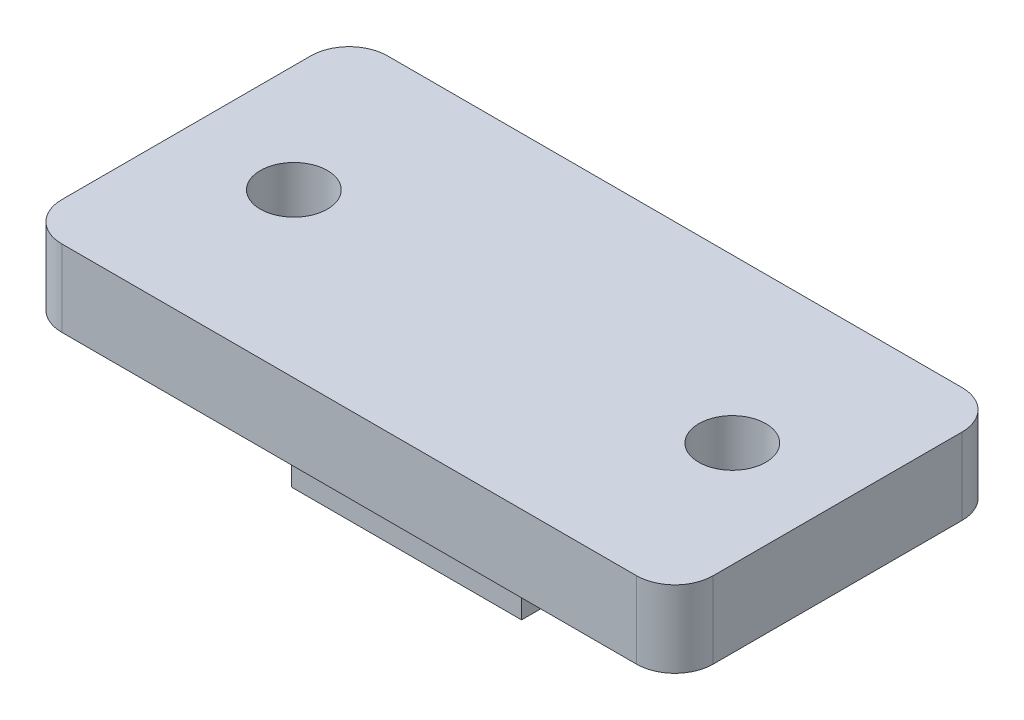
ISO-10303-21;
HEADER;
FILE_DESCRIPTION(('STEP AP214'),'2;1');
FILE_NAME('part.step','',(''),(''),'','','');
FILE_SCHEMA(('AUTOMOTIVE_DESIGN { 1 0 10303 214 1 1 1 1 }'));
ENDSEC;
DATA;
#1=APPLICATION_CONTEXT('core data for automotive mechanical design processes');
#2=APPLICATION_PROTOCOL_DEFINITION('international standard','automotive_design',2000,#1);
#3=PRODUCT_CONTEXT('',#1,'mechanical');
#4=PRODUCT('Part','Part','',(#3));
#5=PRODUCT_RELATED_PRODUCT_CATEGORY('part','',(#4));
#6=PRODUCT_DEFINITION_FORMATION('','',#4);
#7=PRODUCT_DEFINITION_CONTEXT('part definition',#1,'design');
#8=PRODUCT_DEFINITION('design','',#6,#7);
#9=PRODUCT_DEFINITION_SHAPE('','',#8);
#10=(LENGTH_UNIT() NAMED_UNIT(*) SI_UNIT(.MILLI.,.METRE.));
#11=(NAMED_UNIT(*) PLANE_ANGLE_UNIT() SI_UNIT($,.RADIAN.));
#12=(NAMED_UNIT(*) SI_UNIT($,.STERADIAN.) SOLID_ANGLE_UNIT());
#13=UNCERTAINTY_MEASURE_WITH_UNIT(LENGTH_MEASURE(1.E-05),#10,'distance_accuracy_value','');
#14=(GEOMETRIC_REPRESENTATION_CONTEXT(3) GLOBAL_UNCERTAINTY_ASSIGNED_CONTEXT((#13)) GLOBAL_UNIT_ASSIGNED_CONTEXT((#10,
#11,#12)) REPRESENTATION_CONTEXT('',''));
#15=CARTESIAN_POINT('',(0.,0.,0.));
#16=DIRECTION('',(0.,0.,1.));
#17=DIRECTION('',(1.,0.,0.));
#18=AXIS2_PLACEMENT_3D('',#15,#16,#17);
#19=CARTESIAN_POINT('',(0.,4.,0.));
#20=DIRECTION('',(1.,0.,0.));
#21=DIRECTION('',(0.,0.,-1.));
#22=AXIS2_PLACEMENT_3D('',#19,#20,#21);
#23=PLANE('',#22);
#24=DIRECTION('',(0.,0.,1.));
#25=VECTOR('',#24,1.);
#26=CARTESIAN_POINT('',(0.,0.,0.));
#27=LINE('',#26,#25);
#28=CARTESIAN_POINT('',(0.,0.,0.));
#29=VERTEX_POINT('',#28);
#30=CARTESIAN_POINT('',(0.,0.,11.));
#31=VERTEX_POINT('',#30);
#32=EDGE_CURVE('E153',#29,#31,#27,.T.);
#33=ORIENTED_EDGE('',*,*,#32,.T.);
#34=DIRECTION('',(0.,-1.,0.));
#35=VECTOR('',#34,1.);
#36=CARTESIAN_POINT('',(0.,4.,11.));
#37=LINE('',#36,#35);
#38=CARTESIAN_POINT('',(0.,4.,11.));
#39=VERTEX_POINT('',#38);
#40=EDGE_CURVE('E130',#39,#31,#37,.T.);
#41=ORIENTED_EDGE('',*,*,#40,.F.);
#42=DIRECTION('',(0.,0.,1.));
#43=VECTOR('',#42,1.);
#44=CARTESIAN_POINT('',(0.,4.,0.));
#45=LINE('',#44,#43);
#46=CARTESIAN_POINT('',(0.,4.,0.));
#47=VERTEX_POINT('',#46);
#48=EDGE_CURVE('E124',#47,#39,#45,.T.);
#49=ORIENTED_EDGE('',*,*,#48,.F.);
#50=DIRECTION('',(0.,-1.,0.));
#51=VECTOR('',#50,1.);
#52=CARTESIAN_POINT('',(0.,4.,0.));
#53=LINE('',#52,#51);
#54=EDGE_CURVE('E127',#47,#29,#53,.T.);
#55=ORIENTED_EDGE('',*,*,#54,.T.);
#56=EDGE_LOOP('',(#33,#41,#49,#55));
#57=FACE_BOUND('',#56,.T.);
#58=ADVANCED_FACE('F33',(#57),#23,.F.);
#59=CARTESIAN_POINT('',(0.,4.,11.));
#60=DIRECTION('',(0.,0.,-1.));
#61=DIRECTION('',(-1.,0.,0.));
#62=AXIS2_PLACEMENT_3D('',#59,#60,#61);
#63=PLANE('',#62);
#64=DIRECTION('',(1.,0.,0.));
#65=VECTOR('',#64,1.);
#66=CARTESIAN_POINT('',(0.,0.,11.));
#67=LINE('',#66,#65);
#68=CARTESIAN_POINT('',(12.,0.,11.));
#69=VERTEX_POINT('',#68);
#70=EDGE_CURVE('E155',#31,#69,#67,.T.);
#71=ORIENTED_EDGE('',*,*,#70,.T.);
#72=DIRECTION('',(0.,-1.,0.));
#73=VECTOR('',#72,1.);
#74=CARTESIAN_POINT('',(12.,4.,11.));
#75=LINE('',#74,#73);
#76=CARTESIAN_POINT('',(12.,4.,11.));
#77=VERTEX_POINT('',#76);
#78=EDGE_CURVE('E162',#77,#69,#75,.T.);
#79=ORIENTED_EDGE('',*,*,#78,.F.);
#80=DIRECTION('',(1.,0.,0.));
#81=VECTOR('',#80,1.);
#82=CARTESIAN_POINT('',(0.,4.,11.));
#83=LINE('',#82,#81);
#84=EDGE_CURVE('E134',#39,#77,#83,.T.);
#85=ORIENTED_EDGE('',*,*,#84,.F.);
#86=ORIENTED_EDGE('',*,*,#40,.T.);
#87=EDGE_LOOP('',(#71,#79,#85,#86));
#88=FACE_BOUND('',#87,.T.);
#89=ADVANCED_FACE('F225',(#88),#63,.F.);
#90=CARTESIAN_POINT('',(12.,4.,0.));
#91=DIRECTION('',(-1.,0.,0.));
#92=DIRECTION('',(0.,0.,1.));
#93=AXIS2_PLACEMENT_3D('',#90,#91,#92);
#94=PLANE('',#93);
#95=DIRECTION('',(0.,0.,-1.));
#96=VECTOR('',#95,1.);
#97=CARTESIAN_POINT('',(12.,0.,0.));
#98=LINE('',#97,#96);
#99=CARTESIAN_POINT('',(12.,0.,0.));
#100=VERTEX_POINT('',#99);
#101=EDGE_CURVE('E158',#69,#100,#98,.T.);
#102=ORIENTED_EDGE('',*,*,#101,.T.);
#103=DIRECTION('',(0.,-1.,0.));
#104=VECTOR('',#103,1.);
#105=CARTESIAN_POINT('',(12.,4.,0.));
#106=LINE('',#105,#104);
#107=CARTESIAN_POINT('',(12.,4.,0.));
#108=VERTEX_POINT('',#107);
#109=EDGE_CURVE('E144',#108,#100,#106,.T.);
#110=ORIENTED_EDGE('',*,*,#109,.F.);
#111=DIRECTION('',(0.,0.,-1.));
#112=VECTOR('',#111,1.);
#113=CARTESIAN_POINT('',(12.,4.,0.));
#114=LINE('',#113,#112);
#115=EDGE_CURVE('E148',#77,#108,#114,.T.);
#116=ORIENTED_EDGE('',*,*,#115,.F.);
#117=ORIENTED_EDGE('',*,*,#78,.T.);
#118=EDGE_LOOP('',(#102,#110,#116,#117));
#119=FACE_BOUND('',#118,.T.);
#120=ADVANCED_FACE('F228',(#119),#94,.F.);
#121=CARTESIAN_POINT('',(0.,4.,0.));
#122=DIRECTION('',(0.,0.,1.));
#123=DIRECTION('',(1.,0.,0.));
#124=AXIS2_PLACEMENT_3D('',#121,#122,#123);
#125=PLANE('',#124);
#126=DIRECTION('',(-1.,0.,0.));
#127=VECTOR('',#126,1.);
#128=CARTESIAN_POINT('',(0.,0.,0.));
#129=LINE('',#128,#127);
#130=EDGE_CURVE('E135',#100,#29,#129,.T.);
#131=ORIENTED_EDGE('',*,*,#130,.T.);
#132=ORIENTED_EDGE('',*,*,#54,.F.);
#133=DIRECTION('',(-1.,0.,0.));
#134=VECTOR('',#133,1.);
#135=CARTESIAN_POINT('',(0.,4.,0.));
#136=LINE('',#135,#134);
#137=EDGE_CURVE('E141',#108,#47,#136,.T.);
#138=ORIENTED_EDGE('',*,*,#137,.F.);
#139=ORIENTED_EDGE('',*,*,#109,.T.);
#140=EDGE_LOOP('',(#131,#132,#138,#139));
#141=FACE_BOUND('',#140,.T.);
#142=ADVANCED_FACE('F139',(#141),#125,.F.);
#143=CARTESIAN_POINT('',(0.,0.,0.));
#144=DIRECTION('',(0.,1.,0.));
#145=DIRECTION('',(0.,0.,1.));
#146=AXIS2_PLACEMENT_3D('',#143,#144,#145);
#147=PLANE('',#146);
#148=ORIENTED_EDGE('',*,*,#32,.F.);
#149=ORIENTED_EDGE('',*,*,#130,.F.);
#150=ORIENTED_EDGE('',*,*,#101,.F.);
#151=ORIENTED_EDGE('',*,*,#70,.F.);
#152=EDGE_LOOP('',(#148,#149,#150,#151));
#153=FACE_BOUND('',#152,.T.);
#154=ADVANCED_FACE('F230',(#153),#147,.F.);
#155=CARTESIAN_POINT('',(0.,4.,0.));
#156=DIRECTION('',(0.,1.,0.));
#157=DIRECTION('',(0.,0.,1.));
#158=AXIS2_PLACEMENT_3D('',#155,#156,#157);
#159=PLANE('',#158);
#160=CARTESIAN_POINT('',(-5.38539953723421,4.,5.5));
#161=DIRECTION('',(0.,-1.,0.));
#162=DIRECTION('',(0.,0.,-1.));
#163=AXIS2_PLACEMENT_3D('',#160,#161,#162);
#164=CIRCLE('',#163,1.75);
#165=CARTESIAN_POINT('',(-5.38539953723421,4.,3.75));
#166=VERTEX_POINT('',#165);
#167=EDGE_CURVE('E216',#166,#166,#164,.T.);
#168=ORIENTED_EDGE('',*,*,#167,.F.);
#169=EDGE_LOOP('',(#168));
#170=FACE_BOUND('',#169,.T.);
#171=CARTESIAN_POINT('',(17.5,4.,5.5));
#172=DIRECTION('',(0.,-1.,0.));
#173=DIRECTION('',(0.,0.,-1.));
#174=AXIS2_PLACEMENT_3D('',#171,#172,#173);
#175=CIRCLE('',#174,1.75);
#176=CARTESIAN_POINT('',(17.5,4.,3.75));
#177=VERTEX_POINT('',#176);
#178=EDGE_CURVE('E280',#177,#177,#175,.T.);
#179=ORIENTED_EDGE('',*,*,#178,.F.);
#180=EDGE_LOOP('',(#179));
#181=FACE_BOUND('',#180,.T.);
#182=DIRECTION('',(1.,0.,0.));
#183=VECTOR('',#182,1.);
#184=CARTESIAN_POINT('',(-11.,4.,14.));
#185=LINE('',#184,#183);
#186=CARTESIAN_POINT('',(-9.,4.,14.));
#187=VERTEX_POINT('',#186);
#188=CARTESIAN_POINT('',(21.,4.,14.));
#189=VERTEX_POINT('',#188);
#190=EDGE_CURVE('E223',#187,#189,#185,.T.);
#191=ORIENTED_EDGE('',*,*,#190,.F.);
#192=CARTESIAN_POINT('',(-9.,4.,12.));
#193=DIRECTION('',(0.,1.,0.));
#194=DIRECTION('',(0.,0.,1.));
#195=AXIS2_PLACEMENT_3D('',#192,#193,#194);
#196=CIRCLE('',#195,2.);
#197=CARTESIAN_POINT('',(-11.,4.,12.));
#198=VERTEX_POINT('',#197);
#199=EDGE_CURVE('E177',#187,#198,#196,.F.);
#200=ORIENTED_EDGE('',*,*,#199,.T.);
#201=DIRECTION('',(0.,0.,1.));
#202=VECTOR('',#201,1.);
#203=CARTESIAN_POINT('',(-11.,4.,-3.));
#204=LINE('',#203,#202);
#205=CARTESIAN_POINT('',(-11.,4.,-1.));
#206=VERTEX_POINT('',#205);
#207=EDGE_CURVE('E213',#206,#198,#204,.T.);
#208=ORIENTED_EDGE('',*,*,#207,.F.);
#209=CARTESIAN_POINT('',(-9.,4.,-1.));
#210=DIRECTION('',(0.,1.,0.));
#211=DIRECTION('',(0.,0.,1.));
#212=AXIS2_PLACEMENT_3D('',#209,#210,#211);
#213=CIRCLE('',#212,2.);
#214=CARTESIAN_POINT('',(-9.,4.,-3.));
#215=VERTEX_POINT('',#214);
#216=EDGE_CURVE('E175',#206,#215,#213,.F.);
#217=ORIENTED_EDGE('',*,*,#216,.T.);
#218=DIRECTION('',(-1.,0.,0.));
#219=VECTOR('',#218,1.);
#220=CARTESIAN_POINT('',(-11.,4.,-3.));
#221=LINE('',#220,#219);
#222=CARTESIAN_POINT('',(21.,4.,-3.));
#223=VERTEX_POINT('',#222);
#224=EDGE_CURVE('E210',#223,#215,#221,.T.);
#225=ORIENTED_EDGE('',*,*,#224,.F.);
#226=CARTESIAN_POINT('',(21.,4.,-1.));
#227=DIRECTION('',(0.,1.,0.));
#228=DIRECTION('',(0.,0.,1.));
#229=AXIS2_PLACEMENT_3D('',#226,#227,#228);
#230=CIRCLE('',#229,2.);
#231=CARTESIAN_POINT('',(23.,4.,-1.));
#232=VERTEX_POINT('',#231);
#233=EDGE_CURVE('E173',#223,#232,#230,.F.);
#234=ORIENTED_EDGE('',*,*,#233,.T.);
#235=DIRECTION('',(0.,0.,-1.));
#236=VECTOR('',#235,1.);
#237=CARTESIAN_POINT('',(23.,4.,-3.));
#238=LINE('',#237,#236);
#239=CARTESIAN_POINT('',(23.,4.,12.));
#240=VERTEX_POINT('',#239);
#241=EDGE_CURVE('E201',#240,#232,#238,.T.);
#242=ORIENTED_EDGE('',*,*,#241,.F.);
#243=CARTESIAN_POINT('',(21.,4.,12.));
#244=DIRECTION('',(0.,1.,0.));
#245=DIRECTION('',(0.,0.,1.));
#246=AXIS2_PLACEMENT_3D('',#243,#244,#245);
#247=CIRCLE('',#246,2.);
#248=EDGE_CURVE('E171',#240,#189,#247,.F.);
#249=ORIENTED_EDGE('',*,*,#248,.T.);
#250=EDGE_LOOP('',(#191,#200,#208,#217,#225,#234,#242,#249));
#251=FACE_BOUND('',#250,.T.);
#252=ORIENTED_EDGE('',*,*,#137,.T.);
#253=ORIENTED_EDGE('',*,*,#48,.T.);
#254=ORIENTED_EDGE('',*,*,#84,.T.);
#255=ORIENTED_EDGE('',*,*,#115,.T.);
#256=EDGE_LOOP('',(#252,#253,#254,#255));
#257=FACE_BOUND('',#256,.T.);
#258=ADVANCED_FACE('F146',(#170,#181,#251,#257),#159,.F.);
#259=CARTESIAN_POINT('',(23.,8.,-3.));
#260=DIRECTION('',(-1.,0.,0.));
#261=DIRECTION('',(0.,0.,1.));
#262=AXIS2_PLACEMENT_3D('',#259,#260,#261);
#263=PLANE('',#262);
#264=ORIENTED_EDGE('',*,*,#241,.T.);
#265=DIRECTION('',(0.,-1.,0.));
#266=VECTOR('',#265,1.);
#267=CARTESIAN_POINT('',(23.,8.,-1.));
#268=LINE('',#267,#266);
#269=CARTESIAN_POINT('',(23.,8.,-1.));
#270=VERTEX_POINT('',#269);
#271=EDGE_CURVE('E11',#232,#270,#268,.F.);
#272=ORIENTED_EDGE('',*,*,#271,.T.);
#273=DIRECTION('',(0.,0.,-1.));
#274=VECTOR('',#273,1.);
#275=CARTESIAN_POINT('',(23.,8.,-3.));
#276=LINE('',#275,#274);
#277=CARTESIAN_POINT('',(23.,8.,12.));
#278=VERTEX_POINT('',#277);
#279=EDGE_CURVE('E203',#278,#270,#276,.T.);
#280=ORIENTED_EDGE('',*,*,#279,.F.);
#281=DIRECTION('',(0.,-1.,0.));
#282=VECTOR('',#281,1.);
#283=CARTESIAN_POINT('',(23.,8.,12.));
#284=LINE('',#283,#282);
#285=EDGE_CURVE('E41',#278,#240,#284,.T.);
#286=ORIENTED_EDGE('',*,*,#285,.T.);
#287=EDGE_LOOP('',(#264,#272,#280,#286));
#288=FACE_BOUND('',#287,.T.);
#289=ADVANCED_FACE('F200',(#288),#263,.F.);
#290=CARTESIAN_POINT('',(-11.,8.,-3.));
#291=DIRECTION('',(0.,0.,1.));
#292=DIRECTION('',(1.,0.,0.));
#293=AXIS2_PLACEMENT_3D('',#290,#291,#292);
#294=PLANE('',#293);
#295=ORIENTED_EDGE('',*,*,#224,.T.);
#296=DIRECTION('',(0.,-1.,0.));
#297=VECTOR('',#296,1.);
#298=CARTESIAN_POINT('',(-9.,8.,-3.));
#299=LINE('',#298,#297);
#300=CARTESIAN_POINT('',(-9.,8.,-3.));
#301=VERTEX_POINT('',#300);
#302=EDGE_CURVE('E48',#215,#301,#299,.F.);
#303=ORIENTED_EDGE('',*,*,#302,.T.);
#304=DIRECTION('',(-1.,0.,0.));
#305=VECTOR('',#304,1.);
#306=CARTESIAN_POINT('',(-11.,8.,-3.));
#307=LINE('',#306,#305);
#308=CARTESIAN_POINT('',(21.,8.,-3.));
#309=VERTEX_POINT('',#308);
#310=EDGE_CURVE('E265',#309,#301,#307,.T.);
#311=ORIENTED_EDGE('',*,*,#310,.F.);
#312=DIRECTION('',(0.,-1.,0.));
#313=VECTOR('',#312,1.);
#314=CARTESIAN_POINT('',(21.,8.,-3.));
#315=LINE('',#314,#313);
#316=EDGE_CURVE('E191',#309,#223,#315,.T.);
#317=ORIENTED_EDGE('',*,*,#316,.T.);
#318=EDGE_LOOP('',(#295,#303,#311,#317));
#319=FACE_BOUND('',#318,.T.);
#320=ADVANCED_FACE('F264',(#319),#294,.F.);
#321=CARTESIAN_POINT('',(-11.,8.,-3.));
#322=DIRECTION('',(1.,0.,0.));
#323=DIRECTION('',(0.,0.,-1.));
#324=AXIS2_PLACEMENT_3D('',#321,#322,#323);
#325=PLANE('',#324);
#326=ORIENTED_EDGE('',*,*,#207,.T.);
#327=DIRECTION('',(0.,-1.,0.));
#328=VECTOR('',#327,1.);
#329=CARTESIAN_POINT('',(-11.,8.,12.));
#330=LINE('',#329,#328);
#331=CARTESIAN_POINT('',(-11.,8.,12.));
#332=VERTEX_POINT('',#331);
#333=EDGE_CURVE('E182',#198,#332,#330,.F.);
#334=ORIENTED_EDGE('',*,*,#333,.T.);
#335=DIRECTION('',(0.,0.,1.));
#336=VECTOR('',#335,1.);
#337=CARTESIAN_POINT('',(-11.,8.,-3.));
#338=LINE('',#337,#336);
#339=CARTESIAN_POINT('',(-11.,8.,-1.));
#340=VERTEX_POINT('',#339);
#341=EDGE_CURVE('E274',#340,#332,#338,.T.);
#342=ORIENTED_EDGE('',*,*,#341,.F.);
#343=DIRECTION('',(0.,-1.,0.));
#344=VECTOR('',#343,1.);
#345=CARTESIAN_POINT('',(-11.,8.,-1.));
#346=LINE('',#345,#344);
#347=EDGE_CURVE('E179',#340,#206,#346,.T.);
#348=ORIENTED_EDGE('',*,*,#347,.T.);
#349=EDGE_LOOP('',(#326,#334,#342,#348));
#350=FACE_BOUND('',#349,.T.);
#351=ADVANCED_FACE('F271',(#350),#325,.F.);
#352=CARTESIAN_POINT('',(-11.,8.,14.));
#353=DIRECTION('',(0.,0.,-1.));
#354=DIRECTION('',(-1.,0.,0.));
#355=AXIS2_PLACEMENT_3D('',#352,#353,#354);
#356=PLANE('',#355);
#357=DIRECTION('',(1.,0.,0.));
#358=VECTOR('',#357,1.);
#359=CARTESIAN_POINT('',(-11.,8.,14.));
#360=LINE('',#359,#358);
#361=CARTESIAN_POINT('',(-9.,8.,14.));
#362=VERTEX_POINT('',#361);
#363=CARTESIAN_POINT('',(21.,8.,14.));
#364=VERTEX_POINT('',#363);
#365=EDGE_CURVE('E156',#362,#364,#360,.T.);
#366=ORIENTED_EDGE('',*,*,#365,.F.);
#367=DIRECTION('',(0.,-1.,0.));
#368=VECTOR('',#367,1.);
#369=CARTESIAN_POINT('',(-9.,8.,14.));
#370=LINE('',#369,#368);
#371=EDGE_CURVE('E168',#362,#187,#370,.T.);
#372=ORIENTED_EDGE('',*,*,#371,.T.);
#373=ORIENTED_EDGE('',*,*,#190,.T.);
#374=DIRECTION('',(0.,-1.,0.));
#375=VECTOR('',#374,1.);
#376=CARTESIAN_POINT('',(21.,8.,14.));
#377=LINE('',#376,#375);
#378=EDGE_CURVE('E166',#189,#364,#377,.F.);
#379=ORIENTED_EDGE('',*,*,#378,.T.);
#380=EDGE_LOOP('',(#366,#372,#373,#379));
#381=FACE_BOUND('',#380,.T.);
#382=ADVANCED_FACE('F303',(#381),#356,.F.);
#383=CARTESIAN_POINT('',(0.,8.,0.));
#384=DIRECTION('',(0.,1.,0.));
#385=DIRECTION('',(0.,0.,1.));
#386=AXIS2_PLACEMENT_3D('',#383,#384,#385);
#387=PLANE('',#386);
#388=CARTESIAN_POINT('',(-5.38539953723421,8.,5.5));
#389=DIRECTION('',(0.,-1.,0.));
#390=DIRECTION('',(0.,0.,-1.));
#391=AXIS2_PLACEMENT_3D('',#388,#389,#390);
#392=CIRCLE('',#391,1.75);
#393=CARTESIAN_POINT('',(-5.38539953723421,8.,3.75));
#394=VERTEX_POINT('',#393);
#395=EDGE_CURVE('E211',#394,#394,#392,.T.);
#396=ORIENTED_EDGE('',*,*,#395,.T.);
#397=EDGE_LOOP('',(#396));
#398=FACE_BOUND('',#397,.T.);
#399=CARTESIAN_POINT('',(17.5,8.,5.5));
#400=DIRECTION('',(0.,-1.,0.));
#401=DIRECTION('',(0.,0.,-1.));
#402=AXIS2_PLACEMENT_3D('',#399,#400,#401);
#403=CIRCLE('',#402,1.75);
#404=CARTESIAN_POINT('',(17.5,8.,3.75));
#405=VERTEX_POINT('',#404);
#406=EDGE_CURVE('E283',#405,#405,#403,.T.);
#407=ORIENTED_EDGE('',*,*,#406,.T.);
#408=EDGE_LOOP('',(#407));
#409=FACE_BOUND('',#408,.T.);
#410=ORIENTED_EDGE('',*,*,#341,.T.);
#411=CARTESIAN_POINT('',(-9.,8.,12.));
#412=DIRECTION('',(0.,1.,0.));
#413=DIRECTION('',(0.,0.,1.));
#414=AXIS2_PLACEMENT_3D('',#411,#412,#413);
#415=CIRCLE('',#414,2.);
#416=EDGE_CURVE('E189',#332,#362,#415,.T.);
#417=ORIENTED_EDGE('',*,*,#416,.T.);
#418=ORIENTED_EDGE('',*,*,#365,.T.);
#419=CARTESIAN_POINT('',(21.,8.,12.));
#420=DIRECTION('',(0.,1.,0.));
#421=DIRECTION('',(0.,0.,1.));
#422=AXIS2_PLACEMENT_3D('',#419,#420,#421);
#423=CIRCLE('',#422,2.);
#424=EDGE_CURVE('E184',#364,#278,#423,.T.);
#425=ORIENTED_EDGE('',*,*,#424,.T.);
#426=ORIENTED_EDGE('',*,*,#279,.T.);
#427=CARTESIAN_POINT('',(21.,8.,-1.));
#428=DIRECTION('',(0.,1.,0.));
#429=DIRECTION('',(0.,0.,1.));
#430=AXIS2_PLACEMENT_3D('',#427,#428,#429);
#431=CIRCLE('',#430,2.);
#432=EDGE_CURVE('E55',#270,#309,#431,.T.);
#433=ORIENTED_EDGE('',*,*,#432,.T.);
#434=ORIENTED_EDGE('',*,*,#310,.T.);
#435=CARTESIAN_POINT('',(-9.,8.,-1.));
#436=DIRECTION('',(0.,1.,0.));
#437=DIRECTION('',(0.,0.,1.));
#438=AXIS2_PLACEMENT_3D('',#435,#436,#437);
#439=CIRCLE('',#438,2.);
#440=EDGE_CURVE('E187',#301,#340,#439,.T.);
#441=ORIENTED_EDGE('',*,*,#440,.T.);
#442=EDGE_LOOP('',(#410,#417,#418,#425,#426,#433,#434,#441));
#443=FACE_BOUND('',#442,.T.);
#444=ADVANCED_FACE('F294',(#398,#409,#443),#387,.T.);
#445=CARTESIAN_POINT('',(17.5,8.,5.5));
#446=DIRECTION('',(0.,-1.,0.));
#447=DIRECTION('',(0.,0.,-1.));
#448=AXIS2_PLACEMENT_3D('',#445,#446,#447);
#449=CYLINDRICAL_SURFACE('',#448,1.75);
#450=ORIENTED_EDGE('',*,*,#406,.F.);
#451=EDGE_LOOP('',(#450));
#452=FACE_BOUND('',#451,.T.);
#453=ORIENTED_EDGE('',*,*,#178,.T.);
#454=EDGE_LOOP('',(#453));
#455=FACE_BOUND('',#454,.T.);
#456=ADVANCED_FACE('F292',(#452,#455),#449,.F.);
#457=CARTESIAN_POINT('',(-5.38539953723421,8.,5.5));
#458=DIRECTION('',(0.,-1.,0.));
#459=DIRECTION('',(0.,0.,-1.));
#460=AXIS2_PLACEMENT_3D('',#457,#458,#459);
#461=CYLINDRICAL_SURFACE('',#460,1.75);
#462=ORIENTED_EDGE('',*,*,#395,.F.);
#463=EDGE_LOOP('',(#462));
#464=FACE_BOUND('',#463,.T.);
#465=ORIENTED_EDGE('',*,*,#167,.T.);
#466=EDGE_LOOP('',(#465));
#467=FACE_BOUND('',#466,.T.);
#468=ADVANCED_FACE('F253',(#464,#467),#461,.F.);
#469=CARTESIAN_POINT('',(-9.,8.,12.));
#470=DIRECTION('',(0.,-1.,0.));
#471=DIRECTION('',(0.,0.,-1.));
#472=AXIS2_PLACEMENT_3D('',#469,#470,#471);
#473=CYLINDRICAL_SURFACE('',#472,2.);
#474=ORIENTED_EDGE('',*,*,#416,.F.);
#475=ORIENTED_EDGE('',*,*,#333,.F.);
#476=ORIENTED_EDGE('',*,*,#199,.F.);
#477=ORIENTED_EDGE('',*,*,#371,.F.);
#478=EDGE_LOOP('',(#474,#475,#476,#477));
#479=FACE_BOUND('',#478,.T.);
#480=ADVANCED_FACE('F249',(#479),#473,.T.);
#481=CARTESIAN_POINT('',(-9.,8.,-1.));
#482=DIRECTION('',(0.,-1.,0.));
#483=DIRECTION('',(0.,0.,-1.));
#484=AXIS2_PLACEMENT_3D('',#481,#482,#483);
#485=CYLINDRICAL_SURFACE('',#484,2.);
#486=ORIENTED_EDGE('',*,*,#440,.F.);
#487=ORIENTED_EDGE('',*,*,#302,.F.);
#488=ORIENTED_EDGE('',*,*,#216,.F.);
#489=ORIENTED_EDGE('',*,*,#347,.F.);
#490=EDGE_LOOP('',(#486,#487,#488,#489));
#491=FACE_BOUND('',#490,.T.);
#492=ADVANCED_FACE('F252',(#491),#485,.T.);
#493=CARTESIAN_POINT('',(21.,8.,-1.));
#494=DIRECTION('',(0.,-1.,0.));
#495=DIRECTION('',(0.,0.,-1.));
#496=AXIS2_PLACEMENT_3D('',#493,#494,#495);
#497=CYLINDRICAL_SURFACE('',#496,2.);
#498=ORIENTED_EDGE('',*,*,#432,.F.);
#499=ORIENTED_EDGE('',*,*,#271,.F.);
#500=ORIENTED_EDGE('',*,*,#233,.F.);
#501=ORIENTED_EDGE('',*,*,#316,.F.);
#502=EDGE_LOOP('',(#498,#499,#500,#501));
#503=FACE_BOUND('',#502,.T.);
#504=ADVANCED_FACE('F256',(#503),#497,.T.);
#505=CARTESIAN_POINT('',(21.,8.,12.));
#506=DIRECTION('',(0.,-1.,0.));
#507=DIRECTION('',(0.,0.,-1.));
#508=AXIS2_PLACEMENT_3D('',#505,#506,#507);
#509=CYLINDRICAL_SURFACE('',#508,2.);
#510=ORIENTED_EDGE('',*,*,#424,.F.);
#511=ORIENTED_EDGE('',*,*,#378,.F.);
#512=ORIENTED_EDGE('',*,*,#248,.F.);
#513=ORIENTED_EDGE('',*,*,#285,.F.);
#514=EDGE_LOOP('',(#510,#511,#512,#513));
#515=FACE_BOUND('',#514,.T.);
#516=ADVANCED_FACE('F35',(#515),#509,.T.);
#517=CLOSED_SHELL('',(#58,#89,#120,#142,#154,#258,#289,#320,#351,#382,#444,#456,#468,#480,#492,
#504,#516));
#518=MANIFOLD_SOLID_BREP('B2',#517);
#519=ADVANCED_BREP_SHAPE_REPRESENTATION('',(#18,#518),#14);
#520=SHAPE_DEFINITION_REPRESENTATION(#9,#519);
ENDSEC;
END-ISO-10303-21;
